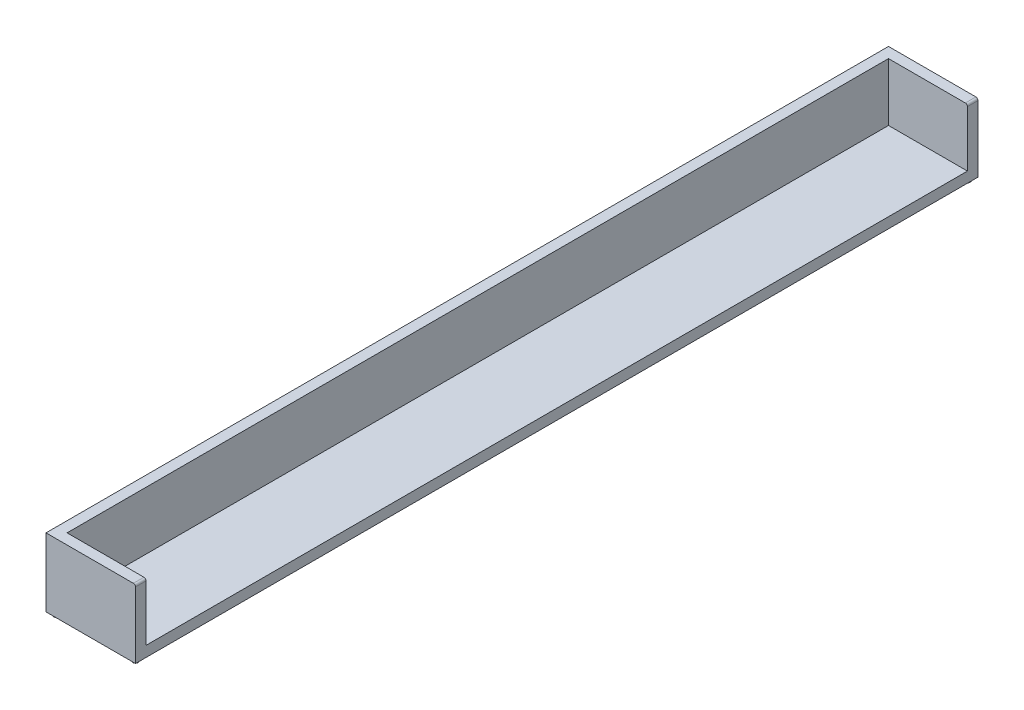
ISO-10303-21;
HEADER;
FILE_DESCRIPTION(('STEP AP214'),'2;1');
FILE_NAME('part.step','',(''),(''),'','','');
FILE_SCHEMA(('AUTOMOTIVE_DESIGN { 1 0 10303 214 1 1 1 1 }'));
ENDSEC;
DATA;
#1=APPLICATION_CONTEXT('core data for automotive mechanical design processes');
#2=APPLICATION_PROTOCOL_DEFINITION('international standard','automotive_design',2000,#1);
#3=PRODUCT_CONTEXT('',#1,'mechanical');
#4=PRODUCT('Part','Part','',(#3));
#5=PRODUCT_RELATED_PRODUCT_CATEGORY('part','',(#4));
#6=PRODUCT_DEFINITION_FORMATION('','',#4);
#7=PRODUCT_DEFINITION_CONTEXT('part definition',#1,'design');
#8=PRODUCT_DEFINITION('design','',#6,#7);
#9=PRODUCT_DEFINITION_SHAPE('','',#8);
#10=(LENGTH_UNIT() NAMED_UNIT(*) SI_UNIT(.MILLI.,.METRE.));
#11=(NAMED_UNIT(*) PLANE_ANGLE_UNIT() SI_UNIT($,.RADIAN.));
#12=(NAMED_UNIT(*) SI_UNIT($,.STERADIAN.) SOLID_ANGLE_UNIT());
#13=UNCERTAINTY_MEASURE_WITH_UNIT(LENGTH_MEASURE(1.E-05),#10,'distance_accuracy_value','');
#14=(GEOMETRIC_REPRESENTATION_CONTEXT(3) GLOBAL_UNCERTAINTY_ASSIGNED_CONTEXT((#13)) GLOBAL_UNIT_ASSIGNED_CONTEXT((#10,
#11,#12)) REPRESENTATION_CONTEXT('',''));
#15=CARTESIAN_POINT('',(0.,0.,0.));
#16=DIRECTION('',(0.,0.,1.));
#17=DIRECTION('',(1.,0.,0.));
#18=AXIS2_PLACEMENT_3D('',#15,#16,#17);
#19=CARTESIAN_POINT('',(405.,305.,8000.));
#20=DIRECTION('',(0.,0.,-1.));
#21=DIRECTION('',(-1.,0.,0.));
#22=AXIS2_PLACEMENT_3D('',#19,#20,#21);
#23=CYLINDRICAL_SURFACE('',#22,20.);
#24=DIRECTION('',(0.,0.,-1.));
#25=VECTOR('',#24,1.);
#26=CARTESIAN_POINT('',(405.,325.,8000.));
#27=LINE('',#26,#25);
#28=CARTESIAN_POINT('',(405.,325.,99.9999999999998));
#29=VERTEX_POINT('',#28);
#30=CARTESIAN_POINT('',(405.,325.,0.));
#31=VERTEX_POINT('',#30);
#32=EDGE_CURVE('E163',#29,#31,#27,.T.);
#33=ORIENTED_EDGE('',*,*,#32,.F.);
#34=CARTESIAN_POINT('',(405.,305.,99.9999999999996));
#35=DIRECTION('',(0.,0.,-1.));
#36=DIRECTION('',(-1.,0.,0.));
#37=AXIS2_PLACEMENT_3D('',#34,#35,#36);
#38=CIRCLE('',#37,20.);
#39=CARTESIAN_POINT('',(425.,305.,99.9999999999998));
#40=VERTEX_POINT('',#39);
#41=EDGE_CURVE('E143',#29,#40,#38,.T.);
#42=ORIENTED_EDGE('',*,*,#41,.T.);
#43=DIRECTION('',(0.,0.,-1.));
#44=VECTOR('',#43,1.);
#45=CARTESIAN_POINT('',(425.,305.,8000.));
#46=LINE('',#45,#44);
#47=CARTESIAN_POINT('',(425.,305.,0.));
#48=VERTEX_POINT('',#47);
#49=EDGE_CURVE('E95',#40,#48,#46,.T.);
#50=ORIENTED_EDGE('',*,*,#49,.T.);
#51=CARTESIAN_POINT('',(405.,305.,0.));
#52=DIRECTION('',(0.,0.,1.));
#53=DIRECTION('',(-1.,0.,0.));
#54=AXIS2_PLACEMENT_3D('',#51,#52,#53);
#55=CIRCLE('',#54,20.);
#56=EDGE_CURVE('E139',#48,#31,#55,.T.);
#57=ORIENTED_EDGE('',*,*,#56,.T.);
#58=EDGE_LOOP('',(#33,#42,#50,#57));
#59=FACE_BOUND('',#58,.T.);
#60=ADVANCED_FACE('F45',(#59),#23,.T.);
#61=CARTESIAN_POINT('',(425.,305.,8000.));
#62=VERTEX_POINT('',#61);
#63=CARTESIAN_POINT('',(425.,305.,7900.));
#64=VERTEX_POINT('',#63);
#65=EDGE_CURVE('E155',#62,#64,#46,.T.);
#66=ORIENTED_EDGE('',*,*,#65,.T.);
#67=CARTESIAN_POINT('',(405.,305.,7900.));
#68=DIRECTION('',(0.,0.,1.));
#69=DIRECTION('',(1.,0.,0.));
#70=AXIS2_PLACEMENT_3D('',#67,#68,#69);
#71=CIRCLE('',#70,20.);
#72=CARTESIAN_POINT('',(405.,325.,7900.));
#73=VERTEX_POINT('',#72);
#74=EDGE_CURVE('E245',#64,#73,#71,.T.);
#75=ORIENTED_EDGE('',*,*,#74,.T.);
#76=CARTESIAN_POINT('',(405.,325.,8000.));
#77=VERTEX_POINT('',#76);
#78=EDGE_CURVE('E164',#77,#73,#27,.T.);
#79=ORIENTED_EDGE('',*,*,#78,.F.);
#80=CARTESIAN_POINT('',(405.,305.,8000.));
#81=DIRECTION('',(0.,0.,1.));
#82=DIRECTION('',(-1.,0.,0.));
#83=AXIS2_PLACEMENT_3D('',#80,#81,#82);
#84=CIRCLE('',#83,20.);
#85=EDGE_CURVE('E154',#62,#77,#84,.T.);
#86=ORIENTED_EDGE('',*,*,#85,.F.);
#87=EDGE_LOOP('',(#66,#75,#79,#86));
#88=FACE_BOUND('',#87,.T.);
#89=ADVANCED_FACE('F47',(#88),#23,.T.);
#90=CARTESIAN_POINT('',(-425.,325.,8000.));
#91=DIRECTION('',(0.,-1.,0.));
#92=DIRECTION('',(0.,0.,-1.));
#93=AXIS2_PLACEMENT_3D('',#90,#91,#92);
#94=PLANE('',#93);
#95=DIRECTION('',(0.,0.,1.));
#96=VECTOR('',#95,1.);
#97=CARTESIAN_POINT('',(-325.,325.,100.));
#98=LINE('',#97,#96);
#99=CARTESIAN_POINT('',(-325.,325.,100.));
#100=VERTEX_POINT('',#99);
#101=CARTESIAN_POINT('',(-324.999999999999,325.,7900.));
#102=VERTEX_POINT('',#101);
#103=EDGE_CURVE('E268',#100,#102,#98,.T.);
#104=ORIENTED_EDGE('',*,*,#103,.F.);
#105=DIRECTION('',(-1.,0.,0.));
#106=VECTOR('',#105,1.);
#107=CARTESIAN_POINT('',(-325.,325.,100.));
#108=LINE('',#107,#106);
#109=EDGE_CURVE('E228',#29,#100,#108,.T.);
#110=ORIENTED_EDGE('',*,*,#109,.F.);
#111=ORIENTED_EDGE('',*,*,#32,.T.);
#112=DIRECTION('',(-1.,0.,0.));
#113=VECTOR('',#112,1.);
#114=CARTESIAN_POINT('',(-425.,325.,0.));
#115=LINE('',#114,#113);
#116=CARTESIAN_POINT('',(-425.,325.,0.));
#117=VERTEX_POINT('',#116);
#118=EDGE_CURVE('E142',#31,#117,#115,.T.);
#119=ORIENTED_EDGE('',*,*,#118,.T.);
#120=DIRECTION('',(0.,0.,-1.));
#121=VECTOR('',#120,1.);
#122=CARTESIAN_POINT('',(-425.,325.,8000.));
#123=LINE('',#122,#121);
#124=CARTESIAN_POINT('',(-425.,325.,8000.));
#125=VERTEX_POINT('',#124);
#126=EDGE_CURVE('E128',#125,#117,#123,.T.);
#127=ORIENTED_EDGE('',*,*,#126,.F.);
#128=DIRECTION('',(-1.,0.,0.));
#129=VECTOR('',#128,1.);
#130=CARTESIAN_POINT('',(-425.,325.,8000.));
#131=LINE('',#130,#129);
#132=EDGE_CURVE('E104',#77,#125,#131,.T.);
#133=ORIENTED_EDGE('',*,*,#132,.F.);
#134=ORIENTED_EDGE('',*,*,#78,.T.);
#135=DIRECTION('',(1.,0.,0.));
#136=VECTOR('',#135,1.);
#137=CARTESIAN_POINT('',(425.,325.,7900.));
#138=LINE('',#137,#136);
#139=EDGE_CURVE('E263',#102,#73,#138,.T.);
#140=ORIENTED_EDGE('',*,*,#139,.F.);
#141=EDGE_LOOP('',(#104,#110,#111,#119,#127,#133,#134,#140));
#142=FACE_BOUND('',#141,.T.);
#143=ADVANCED_FACE('F215',(#142),#94,.F.);
#144=CARTESIAN_POINT('',(-425.,325.,8000.));
#145=DIRECTION('',(1.,0.,0.));
#146=DIRECTION('',(0.,0.,-1.));
#147=AXIS2_PLACEMENT_3D('',#144,#145,#146);
#148=PLANE('',#147);
#149=DIRECTION('',(0.,-1.,0.));
#150=VECTOR('',#149,1.);
#151=CARTESIAN_POINT('',(-425.,325.,0.));
#152=LINE('',#151,#150);
#153=CARTESIAN_POINT('',(-425.,-325.,0.));
#154=VERTEX_POINT('',#153);
#155=EDGE_CURVE('E124',#117,#154,#152,.T.);
#156=ORIENTED_EDGE('',*,*,#155,.T.);
#157=DIRECTION('',(0.,0.,-1.));
#158=VECTOR('',#157,1.);
#159=CARTESIAN_POINT('',(-425.,-325.,8000.));
#160=LINE('',#159,#158);
#161=CARTESIAN_POINT('',(-425.,-325.,8000.));
#162=VERTEX_POINT('',#161);
#163=EDGE_CURVE('E121',#162,#154,#160,.T.);
#164=ORIENTED_EDGE('',*,*,#163,.F.);
#165=DIRECTION('',(0.,-1.,0.));
#166=VECTOR('',#165,1.);
#167=CARTESIAN_POINT('',(-425.,325.,8000.));
#168=LINE('',#167,#166);
#169=EDGE_CURVE('E110',#125,#162,#168,.T.);
#170=ORIENTED_EDGE('',*,*,#169,.F.);
#171=ORIENTED_EDGE('',*,*,#126,.T.);
#172=EDGE_LOOP('',(#156,#164,#170,#171));
#173=FACE_BOUND('',#172,.T.);
#174=ADVANCED_FACE('F122',(#173),#148,.F.);
#175=CARTESIAN_POINT('',(-425.,-325.,8000.));
#176=DIRECTION('',(0.,1.,0.));
#177=DIRECTION('',(0.,0.,1.));
#178=AXIS2_PLACEMENT_3D('',#175,#176,#177);
#179=PLANE('',#178);
#180=CARTESIAN_POINT('',(0.,-325.,4000.));
#181=DIRECTION('',(0.,1.,0.));
#182=DIRECTION('',(0.,0.,1.));
#183=AXIS2_PLACEMENT_3D('',#180,#181,#182);
#184=CIRCLE('',#183,40.);
#185=CARTESIAN_POINT('',(0.,-325.,4040.));
#186=VERTEX_POINT('',#185);
#187=EDGE_CURVE('E11',#186,#186,#184,.F.);
#188=ORIENTED_EDGE('',*,*,#187,.F.);
#189=EDGE_LOOP('',(#188));
#190=FACE_BOUND('',#189,.T.);
#191=CARTESIAN_POINT('',(375.,-325.,49.9999999999998));
#192=DIRECTION('',(0.,1.,0.));
#193=DIRECTION('',(0.,0.,1.));
#194=AXIS2_PLACEMENT_3D('',#191,#192,#193);
#195=CIRCLE('',#194,25.);
#196=CARTESIAN_POINT('',(375.,-325.,74.9999999999998));
#197=VERTEX_POINT('',#196);
#198=EDGE_CURVE('E54',#197,#197,#195,.F.);
#199=ORIENTED_EDGE('',*,*,#198,.F.);
#200=EDGE_LOOP('',(#199));
#201=FACE_BOUND('',#200,.T.);
#202=CARTESIAN_POINT('',(-375.,-325.,49.9999999999998));
#203=DIRECTION('',(0.,1.,0.));
#204=DIRECTION('',(0.,0.,1.));
#205=AXIS2_PLACEMENT_3D('',#202,#203,#204);
#206=CIRCLE('',#205,25.);
#207=CARTESIAN_POINT('',(-375.,-325.,74.9999999999998));
#208=VERTEX_POINT('',#207);
#209=EDGE_CURVE('E175',#208,#208,#206,.F.);
#210=ORIENTED_EDGE('',*,*,#209,.F.);
#211=EDGE_LOOP('',(#210));
#212=FACE_BOUND('',#211,.T.);
#213=CARTESIAN_POINT('',(375.,-325.,7950.));
#214=DIRECTION('',(0.,1.,0.));
#215=DIRECTION('',(0.,0.,1.));
#216=AXIS2_PLACEMENT_3D('',#213,#214,#215);
#217=CIRCLE('',#216,25.0000000000001);
#218=CARTESIAN_POINT('',(375.,-325.,7975.));
#219=VERTEX_POINT('',#218);
#220=EDGE_CURVE('E171',#219,#219,#217,.F.);
#221=ORIENTED_EDGE('',*,*,#220,.F.);
#222=EDGE_LOOP('',(#221));
#223=FACE_BOUND('',#222,.T.);
#224=CARTESIAN_POINT('',(-375.,-325.,7950.));
#225=DIRECTION('',(0.,1.,0.));
#226=DIRECTION('',(0.,0.,1.));
#227=AXIS2_PLACEMENT_3D('',#224,#225,#226);
#228=CIRCLE('',#227,25.0000000000001);
#229=CARTESIAN_POINT('',(-375.,-325.,7975.));
#230=VERTEX_POINT('',#229);
#231=EDGE_CURVE('E167',#230,#230,#228,.F.);
#232=ORIENTED_EDGE('',*,*,#231,.F.);
#233=EDGE_LOOP('',(#232));
#234=FACE_BOUND('',#233,.T.);
#235=DIRECTION('',(1.,0.,0.));
#236=VECTOR('',#235,1.);
#237=CARTESIAN_POINT('',(-425.,-325.,0.));
#238=LINE('',#237,#236);
#239=CARTESIAN_POINT('',(425.,-325.,0.));
#240=VERTEX_POINT('',#239);
#241=EDGE_CURVE('E148',#154,#240,#238,.T.);
#242=ORIENTED_EDGE('',*,*,#241,.T.);
#243=DIRECTION('',(0.,0.,-1.));
#244=VECTOR('',#243,1.);
#245=CARTESIAN_POINT('',(425.,-325.,8000.));
#246=LINE('',#245,#244);
#247=CARTESIAN_POINT('',(425.,-325.,8000.));
#248=VERTEX_POINT('',#247);
#249=EDGE_CURVE('E129',#248,#240,#246,.T.);
#250=ORIENTED_EDGE('',*,*,#249,.F.);
#251=DIRECTION('',(1.,0.,0.));
#252=VECTOR('',#251,1.);
#253=CARTESIAN_POINT('',(-425.,-325.,8000.));
#254=LINE('',#253,#252);
#255=EDGE_CURVE('E114',#162,#248,#254,.T.);
#256=ORIENTED_EDGE('',*,*,#255,.F.);
#257=ORIENTED_EDGE('',*,*,#163,.T.);
#258=EDGE_LOOP('',(#242,#250,#256,#257));
#259=FACE_BOUND('',#258,.T.);
#260=ADVANCED_FACE('F131',(#190,#201,#212,#223,#234,#259),#179,.F.);
#261=CARTESIAN_POINT('',(425.,-325.,8000.));
#262=DIRECTION('',(-1.,0.,0.));
#263=DIRECTION('',(0.,0.,1.));
#264=AXIS2_PLACEMENT_3D('',#261,#262,#263);
#265=PLANE('',#264);
#266=ORIENTED_EDGE('',*,*,#49,.F.);
#267=DIRECTION('',(0.,1.,0.));
#268=VECTOR('',#267,1.);
#269=CARTESIAN_POINT('',(425.,-225.,99.9999999999998));
#270=LINE('',#269,#268);
#271=CARTESIAN_POINT('',(425.,-225.,99.9999999999998));
#272=VERTEX_POINT('',#271);
#273=EDGE_CURVE('E248',#272,#40,#270,.T.);
#274=ORIENTED_EDGE('',*,*,#273,.F.);
#275=DIRECTION('',(0.,0.,-1.));
#276=VECTOR('',#275,1.);
#277=CARTESIAN_POINT('',(425.,-225.,99.9999999999998));
#278=LINE('',#277,#276);
#279=CARTESIAN_POINT('',(425.,-225.,7900.));
#280=VERTEX_POINT('',#279);
#281=EDGE_CURVE('E254',#280,#272,#278,.T.);
#282=ORIENTED_EDGE('',*,*,#281,.F.);
#283=DIRECTION('',(0.,1.,0.));
#284=VECTOR('',#283,1.);
#285=CARTESIAN_POINT('',(425.,-225.,7900.));
#286=LINE('',#285,#284);
#287=EDGE_CURVE('E236',#280,#64,#286,.T.);
#288=ORIENTED_EDGE('',*,*,#287,.T.);
#289=ORIENTED_EDGE('',*,*,#65,.F.);
#290=DIRECTION('',(0.,1.,0.));
#291=VECTOR('',#290,1.);
#292=CARTESIAN_POINT('',(425.,-325.,8000.));
#293=LINE('',#292,#291);
#294=EDGE_CURVE('E70',#248,#62,#293,.T.);
#295=ORIENTED_EDGE('',*,*,#294,.F.);
#296=ORIENTED_EDGE('',*,*,#249,.T.);
#297=DIRECTION('',(0.,1.,0.));
#298=VECTOR('',#297,1.);
#299=CARTESIAN_POINT('',(425.,-325.,0.));
#300=LINE('',#299,#298);
#301=EDGE_CURVE('E151',#240,#48,#300,.T.);
#302=ORIENTED_EDGE('',*,*,#301,.T.);
#303=EDGE_LOOP('',(#266,#274,#282,#288,#289,#295,#296,#302));
#304=FACE_BOUND('',#303,.T.);
#305=ADVANCED_FACE('F186',(#304),#265,.F.);
#306=CARTESIAN_POINT('',(405.,305.,8000.));
#307=DIRECTION('',(0.,0.,-1.));
#308=DIRECTION('',(-1.,0.,0.));
#309=AXIS2_PLACEMENT_3D('',#306,#307,#308);
#310=PLANE('',#309);
#311=ORIENTED_EDGE('',*,*,#85,.T.);
#312=ORIENTED_EDGE('',*,*,#132,.T.);
#313=ORIENTED_EDGE('',*,*,#169,.T.);
#314=ORIENTED_EDGE('',*,*,#255,.T.);
#315=ORIENTED_EDGE('',*,*,#294,.T.);
#316=EDGE_LOOP('',(#311,#312,#313,#314,#315));
#317=FACE_BOUND('',#316,.T.);
#318=ADVANCED_FACE('F112',(#317),#310,.F.);
#319=CARTESIAN_POINT('',(405.,305.,0.));
#320=DIRECTION('',(0.,0.,-1.));
#321=DIRECTION('',(-1.,0.,0.));
#322=AXIS2_PLACEMENT_3D('',#319,#320,#321);
#323=PLANE('',#322);
#324=ORIENTED_EDGE('',*,*,#56,.F.);
#325=ORIENTED_EDGE('',*,*,#301,.F.);
#326=ORIENTED_EDGE('',*,*,#241,.F.);
#327=ORIENTED_EDGE('',*,*,#155,.F.);
#328=ORIENTED_EDGE('',*,*,#118,.F.);
#329=EDGE_LOOP('',(#324,#325,#326,#327,#328));
#330=FACE_BOUND('',#329,.T.);
#331=ADVANCED_FACE('F230',(#330),#323,.T.);
#332=CARTESIAN_POINT('',(-325.,-225.,100.));
#333=DIRECTION('',(0.,0.,-1.));
#334=DIRECTION('',(-1.,0.,0.));
#335=AXIS2_PLACEMENT_3D('',#332,#333,#334);
#336=PLANE('',#335);
#337=ORIENTED_EDGE('',*,*,#109,.T.);
#338=DIRECTION('',(0.,1.,0.));
#339=VECTOR('',#338,1.);
#340=CARTESIAN_POINT('',(-325.,-225.,100.));
#341=LINE('',#340,#339);
#342=CARTESIAN_POINT('',(-325.,-225.,100.));
#343=VERTEX_POINT('',#342);
#344=EDGE_CURVE('E249',#343,#100,#341,.T.);
#345=ORIENTED_EDGE('',*,*,#344,.F.);
#346=DIRECTION('',(-1.,0.,0.));
#347=VECTOR('',#346,1.);
#348=CARTESIAN_POINT('',(-325.,-225.,100.));
#349=LINE('',#348,#347);
#350=EDGE_CURVE('E267',#272,#343,#349,.T.);
#351=ORIENTED_EDGE('',*,*,#350,.F.);
#352=ORIENTED_EDGE('',*,*,#273,.T.);
#353=ORIENTED_EDGE('',*,*,#41,.F.);
#354=EDGE_LOOP('',(#337,#345,#351,#352,#353));
#355=FACE_BOUND('',#354,.T.);
#356=ADVANCED_FACE('F433',(#355),#336,.F.);
#357=CARTESIAN_POINT('',(425.,-225.,7900.));
#358=DIRECTION('',(0.,0.,1.));
#359=DIRECTION('',(1.,0.,0.));
#360=AXIS2_PLACEMENT_3D('',#357,#358,#359);
#361=PLANE('',#360);
#362=ORIENTED_EDGE('',*,*,#287,.F.);
#363=DIRECTION('',(1.,0.,0.));
#364=VECTOR('',#363,1.);
#365=CARTESIAN_POINT('',(425.,-225.,7900.));
#366=LINE('',#365,#364);
#367=CARTESIAN_POINT('',(-324.999999999999,-225.,7900.));
#368=VERTEX_POINT('',#367);
#369=EDGE_CURVE('E61',#368,#280,#366,.T.);
#370=ORIENTED_EDGE('',*,*,#369,.F.);
#371=DIRECTION('',(0.,1.,0.));
#372=VECTOR('',#371,1.);
#373=CARTESIAN_POINT('',(-324.999999999999,-225.,7900.));
#374=LINE('',#373,#372);
#375=EDGE_CURVE('E253',#368,#102,#374,.T.);
#376=ORIENTED_EDGE('',*,*,#375,.T.);
#377=ORIENTED_EDGE('',*,*,#139,.T.);
#378=ORIENTED_EDGE('',*,*,#74,.F.);
#379=EDGE_LOOP('',(#362,#370,#376,#377,#378));
#380=FACE_BOUND('',#379,.T.);
#381=ADVANCED_FACE('F423',(#380),#361,.F.);
#382=CARTESIAN_POINT('',(-325.,-225.,100.));
#383=DIRECTION('',(-1.,0.,0.));
#384=DIRECTION('',(0.,0.,1.));
#385=AXIS2_PLACEMENT_3D('',#382,#383,#384);
#386=PLANE('',#385);
#387=ORIENTED_EDGE('',*,*,#103,.T.);
#388=ORIENTED_EDGE('',*,*,#375,.F.);
#389=DIRECTION('',(0.,0.,1.));
#390=VECTOR('',#389,1.);
#391=CARTESIAN_POINT('',(-325.,-225.,100.));
#392=LINE('',#391,#390);
#393=EDGE_CURVE('E279',#343,#368,#392,.T.);
#394=ORIENTED_EDGE('',*,*,#393,.F.);
#395=ORIENTED_EDGE('',*,*,#344,.T.);
#396=EDGE_LOOP('',(#387,#388,#394,#395));
#397=FACE_BOUND('',#396,.T.);
#398=ADVANCED_FACE('F208',(#397),#386,.F.);
#399=CARTESIAN_POINT('',(0.,-225.,0.));
#400=DIRECTION('',(0.,-1.,0.));
#401=DIRECTION('',(0.,0.,-1.));
#402=AXIS2_PLACEMENT_3D('',#399,#400,#401);
#403=PLANE('',#402);
#404=ORIENTED_EDGE('',*,*,#350,.T.);
#405=ORIENTED_EDGE('',*,*,#393,.T.);
#406=ORIENTED_EDGE('',*,*,#369,.T.);
#407=ORIENTED_EDGE('',*,*,#281,.T.);
#408=EDGE_LOOP('',(#404,#405,#406,#407));
#409=FACE_BOUND('',#408,.T.);
#410=ADVANCED_FACE('F198',(#409),#403,.F.);
#411=CARTESIAN_POINT('',(-375.,-355.,7950.));
#412=DIRECTION('',(0.,1.,0.));
#413=DIRECTION('',(0.,0.,1.));
#414=AXIS2_PLACEMENT_3D('',#411,#412,#413);
#415=CYLINDRICAL_SURFACE('',#414,25.0000000000001);
#416=CARTESIAN_POINT('',(-375.,-355.,7950.));
#417=DIRECTION('',(0.,-1.,0.));
#418=DIRECTION('',(0.,0.,-1.));
#419=AXIS2_PLACEMENT_3D('',#416,#417,#418);
#420=CIRCLE('',#419,25.0000000000001);
#421=CARTESIAN_POINT('',(-375.,-355.,7925.));
#422=VERTEX_POINT('',#421);
#423=EDGE_CURVE('E274',#422,#422,#420,.T.);
#424=ORIENTED_EDGE('',*,*,#423,.F.);
#425=EDGE_LOOP('',(#424));
#426=FACE_BOUND('',#425,.T.);
#427=ORIENTED_EDGE('',*,*,#231,.T.);
#428=EDGE_LOOP('',(#427));
#429=FACE_BOUND('',#428,.T.);
#430=ADVANCED_FACE('F195',(#426,#429),#415,.T.);
#431=CARTESIAN_POINT('',(-375.,-355.,7950.));
#432=DIRECTION('',(0.,-1.,0.));
#433=DIRECTION('',(0.,0.,-1.));
#434=AXIS2_PLACEMENT_3D('',#431,#432,#433);
#435=PLANE('',#434);
#436=ORIENTED_EDGE('',*,*,#423,.T.);
#437=EDGE_LOOP('',(#436));
#438=FACE_BOUND('',#437,.T.);
#439=ADVANCED_FACE('F197',(#438),#435,.T.);
#440=CARTESIAN_POINT('',(375.,-355.,7950.));
#441=DIRECTION('',(0.,1.,0.));
#442=DIRECTION('',(0.,0.,1.));
#443=AXIS2_PLACEMENT_3D('',#440,#441,#442);
#444=CYLINDRICAL_SURFACE('',#443,25.0000000000001);
#445=CARTESIAN_POINT('',(375.,-355.,7950.));
#446=DIRECTION('',(0.,-1.,0.));
#447=DIRECTION('',(0.,0.,-1.));
#448=AXIS2_PLACEMENT_3D('',#445,#446,#447);
#449=CIRCLE('',#448,25.0000000000001);
#450=CARTESIAN_POINT('',(375.,-355.,7925.));
#451=VERTEX_POINT('',#450);
#452=EDGE_CURVE('E288',#451,#451,#449,.T.);
#453=ORIENTED_EDGE('',*,*,#452,.F.);
#454=EDGE_LOOP('',(#453));
#455=FACE_BOUND('',#454,.T.);
#456=ORIENTED_EDGE('',*,*,#220,.T.);
#457=EDGE_LOOP('',(#456));
#458=FACE_BOUND('',#457,.T.);
#459=ADVANCED_FACE('F205',(#455,#458),#444,.T.);
#460=CARTESIAN_POINT('',(375.,-355.,7950.));
#461=DIRECTION('',(0.,-1.,0.));
#462=DIRECTION('',(0.,0.,-1.));
#463=AXIS2_PLACEMENT_3D('',#460,#461,#462);
#464=PLANE('',#463);
#465=ORIENTED_EDGE('',*,*,#452,.T.);
#466=EDGE_LOOP('',(#465));
#467=FACE_BOUND('',#466,.T.);
#468=ADVANCED_FACE('F328',(#467),#464,.T.);
#469=CARTESIAN_POINT('',(-375.,-355.,49.9999999999998));
#470=DIRECTION('',(0.,1.,0.));
#471=DIRECTION('',(0.,0.,1.));
#472=AXIS2_PLACEMENT_3D('',#469,#470,#471);
#473=CYLINDRICAL_SURFACE('',#472,25.);
#474=CARTESIAN_POINT('',(-375.,-355.,49.9999999999998));
#475=DIRECTION('',(0.,-1.,0.));
#476=DIRECTION('',(0.,0.,-1.));
#477=AXIS2_PLACEMENT_3D('',#474,#475,#476);
#478=CIRCLE('',#477,25.);
#479=CARTESIAN_POINT('',(-375.,-355.,24.9999999999998));
#480=VERTEX_POINT('',#479);
#481=EDGE_CURVE('E292',#480,#480,#478,.T.);
#482=ORIENTED_EDGE('',*,*,#481,.F.);
#483=EDGE_LOOP('',(#482));
#484=FACE_BOUND('',#483,.T.);
#485=ORIENTED_EDGE('',*,*,#209,.T.);
#486=EDGE_LOOP('',(#485));
#487=FACE_BOUND('',#486,.T.);
#488=ADVANCED_FACE('F325',(#484,#487),#473,.T.);
#489=CARTESIAN_POINT('',(-375.,-355.,49.9999999999998));
#490=DIRECTION('',(0.,-1.,0.));
#491=DIRECTION('',(0.,0.,-1.));
#492=AXIS2_PLACEMENT_3D('',#489,#490,#491);
#493=PLANE('',#492);
#494=ORIENTED_EDGE('',*,*,#481,.T.);
#495=EDGE_LOOP('',(#494));
#496=FACE_BOUND('',#495,.T.);
#497=ADVANCED_FACE('F322',(#496),#493,.T.);
#498=CARTESIAN_POINT('',(375.,-355.,49.9999999999998));
#499=DIRECTION('',(0.,1.,0.));
#500=DIRECTION('',(0.,0.,1.));
#501=AXIS2_PLACEMENT_3D('',#498,#499,#500);
#502=CYLINDRICAL_SURFACE('',#501,25.);
#503=CARTESIAN_POINT('',(375.,-355.,49.9999999999998));
#504=DIRECTION('',(0.,-1.,0.));
#505=DIRECTION('',(0.,0.,-1.));
#506=AXIS2_PLACEMENT_3D('',#503,#504,#505);
#507=CIRCLE('',#506,25.);
#508=CARTESIAN_POINT('',(375.,-355.,24.9999999999998));
#509=VERTEX_POINT('',#508);
#510=EDGE_CURVE('E296',#509,#509,#507,.T.);
#511=ORIENTED_EDGE('',*,*,#510,.F.);
#512=EDGE_LOOP('',(#511));
#513=FACE_BOUND('',#512,.T.);
#514=ORIENTED_EDGE('',*,*,#198,.T.);
#515=EDGE_LOOP('',(#514));
#516=FACE_BOUND('',#515,.T.);
#517=ADVANCED_FACE('F182',(#513,#516),#502,.T.);
#518=CARTESIAN_POINT('',(375.,-355.,49.9999999999998));
#519=DIRECTION('',(0.,-1.,0.));
#520=DIRECTION('',(0.,0.,-1.));
#521=AXIS2_PLACEMENT_3D('',#518,#519,#520);
#522=PLANE('',#521);
#523=ORIENTED_EDGE('',*,*,#510,.T.);
#524=EDGE_LOOP('',(#523));
#525=FACE_BOUND('',#524,.T.);
#526=ADVANCED_FACE('F310',(#525),#522,.T.);
#527=CARTESIAN_POINT('',(0.,-355.,4000.));
#528=DIRECTION('',(0.,1.,0.));
#529=DIRECTION('',(0.,0.,1.));
#530=AXIS2_PLACEMENT_3D('',#527,#528,#529);
#531=CYLINDRICAL_SURFACE('',#530,40.);
#532=CARTESIAN_POINT('',(0.,-355.,4000.));
#533=DIRECTION('',(0.,-1.,0.));
#534=DIRECTION('',(0.,0.,-1.));
#535=AXIS2_PLACEMENT_3D('',#532,#533,#534);
#536=CIRCLE('',#535,40.);
#537=CARTESIAN_POINT('',(0.,-355.,3960.));
#538=VERTEX_POINT('',#537);
#539=EDGE_CURVE('E300',#538,#538,#536,.T.);
#540=ORIENTED_EDGE('',*,*,#539,.F.);
#541=EDGE_LOOP('',(#540));
#542=FACE_BOUND('',#541,.T.);
#543=ORIENTED_EDGE('',*,*,#187,.T.);
#544=EDGE_LOOP('',(#543));
#545=FACE_BOUND('',#544,.T.);
#546=ADVANCED_FACE('F307',(#542,#545),#531,.T.);
#547=CARTESIAN_POINT('',(0.,-355.,4000.));
#548=DIRECTION('',(0.,-1.,0.));
#549=DIRECTION('',(0.,0.,-1.));
#550=AXIS2_PLACEMENT_3D('',#547,#548,#549);
#551=PLANE('',#550);
#552=ORIENTED_EDGE('',*,*,#539,.T.);
#553=EDGE_LOOP('',(#552));
#554=FACE_BOUND('',#553,.T.);
#555=ADVANCED_FACE('F305',(#554),#551,.T.);
#556=CLOSED_SHELL('',(#60,#89,#143,#174,#260,#305,#318,#331,#356,#381,#398,#410,#430,#439,#459,
#468,#488,#497,#517,#526,#546,#555));
#557=MANIFOLD_SOLID_BREP('B2',#556);
#558=ADVANCED_BREP_SHAPE_REPRESENTATION('',(#18,#557),#14);
#559=SHAPE_DEFINITION_REPRESENTATION(#9,#558);
ENDSEC;
END-ISO-10303-21;
